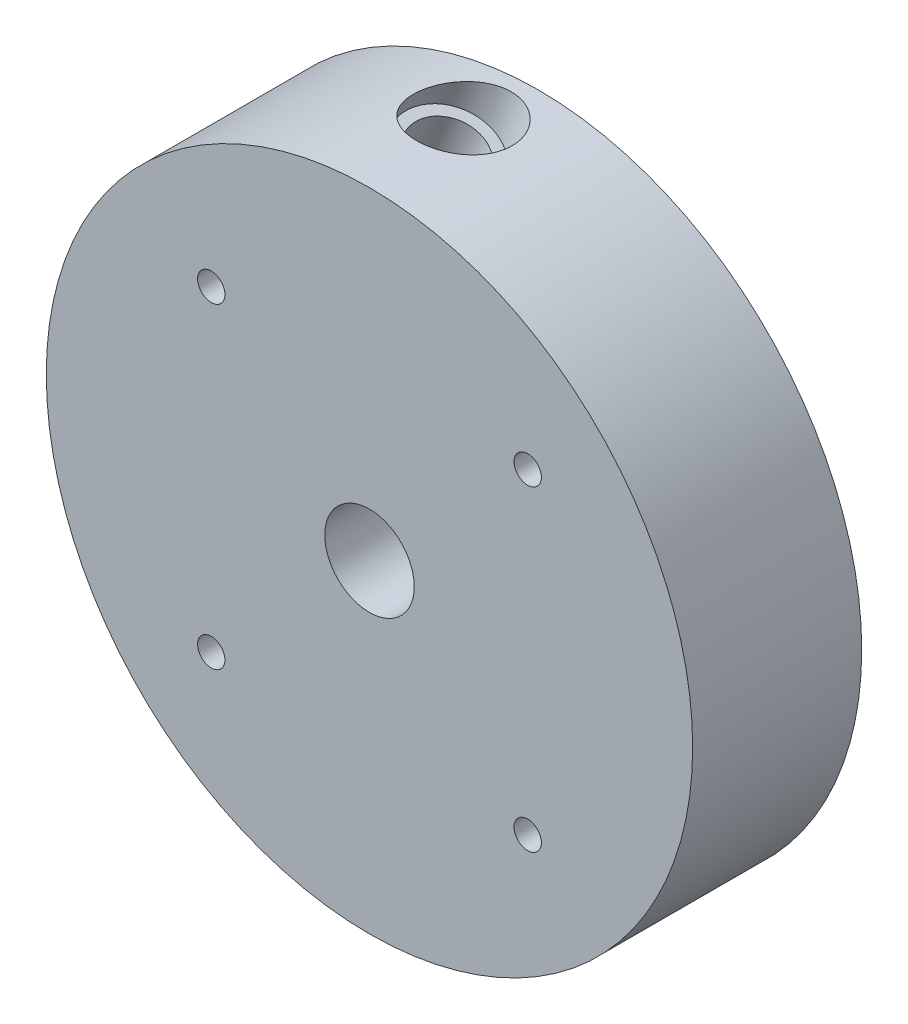
ISO-10303-21;
HEADER;
FILE_DESCRIPTION(('STEP AP214'),'2;1');
FILE_NAME('part.step','',(''),(''),'','','');
FILE_SCHEMA(('AUTOMOTIVE_DESIGN { 1 0 10303 214 1 1 1 1 }'));
ENDSEC;
DATA;
#1=APPLICATION_CONTEXT('core data for automotive mechanical design processes');
#2=APPLICATION_PROTOCOL_DEFINITION('international standard','automotive_design',2000,#1);
#3=PRODUCT_CONTEXT('',#1,'mechanical');
#4=PRODUCT('Part','Part','',(#3));
#5=PRODUCT_RELATED_PRODUCT_CATEGORY('part','',(#4));
#6=PRODUCT_DEFINITION_FORMATION('','',#4);
#7=PRODUCT_DEFINITION_CONTEXT('part definition',#1,'design');
#8=PRODUCT_DEFINITION('design','',#6,#7);
#9=PRODUCT_DEFINITION_SHAPE('','',#8);
#10=(LENGTH_UNIT() NAMED_UNIT(*) SI_UNIT(.MILLI.,.METRE.));
#11=(NAMED_UNIT(*) PLANE_ANGLE_UNIT() SI_UNIT($,.RADIAN.));
#12=(NAMED_UNIT(*) SI_UNIT($,.STERADIAN.) SOLID_ANGLE_UNIT());
#13=UNCERTAINTY_MEASURE_WITH_UNIT(LENGTH_MEASURE(1.E-05),#10,'distance_accuracy_value','');
#14=(GEOMETRIC_REPRESENTATION_CONTEXT(3) GLOBAL_UNCERTAINTY_ASSIGNED_CONTEXT((#13)) GLOBAL_UNIT_ASSIGNED_CONTEXT((#10,
#11,#12)) REPRESENTATION_CONTEXT('',''));
#15=CARTESIAN_POINT('',(0.,0.,0.));
#16=DIRECTION('',(0.,0.,1.));
#17=DIRECTION('',(1.,0.,0.));
#18=AXIS2_PLACEMENT_3D('',#15,#16,#17);
#19=CARTESIAN_POINT('',(0.,0.,34.));
#20=DIRECTION('',(0.,0.,1.));
#21=DIRECTION('',(1.,0.,0.));
#22=AXIS2_PLACEMENT_3D('',#19,#20,#21);
#23=PLANE('',#22);
#24=CARTESIAN_POINT('',(31.8198051533946,31.8198051533946,34.));
#25=DIRECTION('',(0.,0.,1.));
#26=DIRECTION('',(1.,0.,0.));
#27=AXIS2_PLACEMENT_3D('',#24,#25,#26);
#28=CIRCLE('',#27,2.74999999999999);
#29=CARTESIAN_POINT('',(34.5698051533946,31.8198051533946,34.));
#30=VERTEX_POINT('',#29);
#31=EDGE_CURVE('E185',#30,#30,#28,.T.);
#32=ORIENTED_EDGE('',*,*,#31,.F.);
#33=EDGE_LOOP('',(#32));
#34=FACE_BOUND('',#33,.T.);
#35=CARTESIAN_POINT('',(-31.8198051533946,-31.8198051533946,34.));
#36=DIRECTION('',(0.,0.,1.));
#37=DIRECTION('',(1.,0.,0.));
#38=AXIS2_PLACEMENT_3D('',#35,#36,#37);
#39=CIRCLE('',#38,2.74999999999999);
#40=CARTESIAN_POINT('',(-29.0698051533946,-31.8198051533946,34.));
#41=VERTEX_POINT('',#40);
#42=EDGE_CURVE('E189',#41,#41,#39,.T.);
#43=ORIENTED_EDGE('',*,*,#42,.F.);
#44=EDGE_LOOP('',(#43));
#45=FACE_BOUND('',#44,.T.);
#46=CARTESIAN_POINT('',(0.,0.,34.));
#47=DIRECTION('',(0.,0.,1.));
#48=DIRECTION('',(1.,0.,0.));
#49=AXIS2_PLACEMENT_3D('',#46,#47,#48);
#50=CIRCLE('',#49,65.);
#51=CARTESIAN_POINT('',(65.,0.,34.));
#52=VERTEX_POINT('',#51);
#53=EDGE_CURVE('E12',#52,#52,#50,.T.);
#54=ORIENTED_EDGE('',*,*,#53,.T.);
#55=EDGE_LOOP('',(#54));
#56=FACE_BOUND('',#55,.T.);
#57=CARTESIAN_POINT('',(-31.8198051533946,31.8198051533946,34.));
#58=DIRECTION('',(0.,0.,1.));
#59=DIRECTION('',(1.,0.,0.));
#60=AXIS2_PLACEMENT_3D('',#57,#58,#59);
#61=CIRCLE('',#60,2.74999999999999);
#62=CARTESIAN_POINT('',(-29.0698051533946,31.8198051533946,34.));
#63=VERTEX_POINT('',#62);
#64=EDGE_CURVE('E195',#63,#63,#61,.T.);
#65=ORIENTED_EDGE('',*,*,#64,.F.);
#66=EDGE_LOOP('',(#65));
#67=FACE_BOUND('',#66,.T.);
#68=CARTESIAN_POINT('',(31.8198051533946,-31.8198051533946,34.));
#69=DIRECTION('',(0.,0.,1.));
#70=DIRECTION('',(1.,0.,0.));
#71=AXIS2_PLACEMENT_3D('',#68,#69,#70);
#72=CIRCLE('',#71,2.74999999999999);
#73=CARTESIAN_POINT('',(34.5698051533946,-31.8198051533946,34.));
#74=VERTEX_POINT('',#73);
#75=EDGE_CURVE('E199',#74,#74,#72,.T.);
#76=ORIENTED_EDGE('',*,*,#75,.F.);
#77=EDGE_LOOP('',(#76));
#78=FACE_BOUND('',#77,.T.);
#79=CARTESIAN_POINT('',(0.,0.,34.));
#80=DIRECTION('',(0.,0.,1.));
#81=DIRECTION('',(1.,0.,0.));
#82=AXIS2_PLACEMENT_3D('',#79,#80,#81);
#83=CIRCLE('',#82,9.);
#84=CARTESIAN_POINT('',(9.,0.,34.));
#85=VERTEX_POINT('',#84);
#86=EDGE_CURVE('E202',#85,#85,#83,.T.);
#87=ORIENTED_EDGE('',*,*,#86,.F.);
#88=EDGE_LOOP('',(#87));
#89=FACE_BOUND('',#88,.T.);
#90=ADVANCED_FACE('F51',(#34,#45,#56,#67,#78,#89),#23,.T.);
#91=CARTESIAN_POINT('',(0.,-143.141421356237,20.));
#92=DIRECTION('',(0.,0.,1.));
#93=DIRECTION('',(1.,0.,0.));
#94=AXIS2_PLACEMENT_3D('',#91,#92,#93);
#95=PLANE('',#94);
#96=CARTESIAN_POINT('',(-8.41161896583205,31.3925893543947,20.));
#97=CARTESIAN_POINT('',(-6.59498655692887,31.9273439059173,20.));
#98=CARTESIAN_POINT('',(-4.72759665589687,32.3040116625754,20.));
#99=CARTESIAN_POINT('',(-0.947579393855885,32.7269500427533,20.));
#100=CARTESIAN_POINT('',(0.964989800608965,32.7732083727551,20.));
#101=CARTESIAN_POINT('',(4.77710877725085,32.5310810574549,20.));
#102=CARTESIAN_POINT('',(6.6765988909068,32.2426934409023,20.));
#103=CARTESIAN_POINT('',(10.4042078217419,31.337263885961,20.));
#104=CARTESIAN_POINT('',(12.2322672936029,30.7202304457304,20.));
#105=CARTESIAN_POINT('',(15.760360447992,29.173637757705,20.));
#106=CARTESIAN_POINT('',(17.4603369387661,28.2440973030589,20.));
#107=CARTESIAN_POINT('',(20.6790622470469,26.098347596263,20.));
#108=CARTESIAN_POINT('',(22.1977578054618,24.8821669390156,20.));
#109=CARTESIAN_POINT('',(25.0058356427531,22.198009272827,20.));
#110=CARTESIAN_POINT('',(26.2951702677157,20.7300698610981,20.));
#111=CARTESIAN_POINT('',(28.6030770399887,17.5852862615814,20.));
#112=CARTESIAN_POINT('',(29.621608652021,15.9084875898363,20.));
#113=CARTESIAN_POINT('',(31.3544252087226,12.3956449637935,20.));
#114=CARTESIAN_POINT('',(32.0686780431636,10.5596531079759,20.));
#115=CARTESIAN_POINT('',(33.1685124520496,6.78338183568033,20.));
#116=CARTESIAN_POINT('',(33.554071398709,4.84315954999618,20.));
#117=CARTESIAN_POINT('',(33.9819779982146,0.9170386600299,20.));
#118=CARTESIAN_POINT('',(34.0243132794646,-1.06879949890293,20.));
#119=CARTESIAN_POINT('',(33.7616448126502,-5.02565789488448,20.));
#120=CARTESIAN_POINT('',(33.4566394131377,-6.99661620578227,20.));
#121=CARTESIAN_POINT('',(32.5057860053459,-10.8631805220921,20.));
#122=CARTESIAN_POINT('',(31.8599472031514,-12.7587250146704,20.));
#123=CARTESIAN_POINT('',(30.2444344658908,-16.4157462169828,20.));
#124=CARTESIAN_POINT('',(29.274780398416,-18.1771637237506,20.));
#125=CARTESIAN_POINT('',(27.0387184652918,-21.5108525379583,20.));
#126=CARTESIAN_POINT('',(25.772340602703,-23.0830687928153,20.));
#127=CARTESIAN_POINT('',(22.9792358346881,-25.9886347223964,20.));
#128=CARTESIAN_POINT('',(21.4525482253563,-27.3219352222074,20.));
#129=CARTESIAN_POINT('',(18.1835090503277,-29.7068773521282,20.));
#130=CARTESIAN_POINT('',(16.4412049384089,-30.7584772449035,20.));
#131=CARTESIAN_POINT('',(12.7925922031796,-32.5455235820591,20.));
#132=CARTESIAN_POINT('',(10.8863377957731,-33.2809370698108,20.));
#133=CARTESIAN_POINT('',(6.96692751775982,-34.4105391787325,20.));
#134=CARTESIAN_POINT('',(4.95383101040614,-34.8047047072262,20.));
#135=CARTESIAN_POINT('',(0.881572969327515,-35.2370073616113,20.));
#136=CARTESIAN_POINT('',(-1.17752583972078,-35.2751320467303,20.));
#137=CARTESIAN_POINT('',(-5.27905712721527,-34.9913531552568,20.));
#138=CARTESIAN_POINT('',(-7.3214254229152,-34.669448255876,20.));
#139=CARTESIAN_POINT('',(-11.3267805742622,-33.6726219752596,20.));
#140=CARTESIAN_POINT('',(-13.2897037521198,-32.9977105165779,20.));
#141=CARTESIAN_POINT('',(-17.0753954472404,-31.3127657075608,20.));
#142=CARTESIAN_POINT('',(-18.898102754332,-30.3027533072263,20.));
#143=CARTESIAN_POINT('',(-22.3464123691171,-27.9759197387277,20.));
#144=CARTESIAN_POINT('',(-23.9719578360684,-26.6591299889305,20.));
#145=CARTESIAN_POINT('',(-26.9745944537781,-23.7566853350126,20.));
#146=CARTESIAN_POINT('',(-28.3516349151178,-22.1710714319796,20.));
#147=CARTESIAN_POINT('',(-30.8131330293807,-18.7774625019632,20.));
#148=CARTESIAN_POINT('',(-31.897547750371,-16.9695168713819,20.));
#149=CARTESIAN_POINT('',(-33.7382971452239,-13.1849080344906,20.));
#150=CARTESIAN_POINT('',(-34.4945980242525,-11.2083011650251,20.));
#151=CARTESIAN_POINT('',(-35.653409824858,-7.14562096872495,20.));
#152=CARTESIAN_POINT('',(-36.0558971975498,-5.05960923964018,20.));
#153=CARTESIAN_POINT('',(-36.492023630975,-0.841182207962756,20.));
#154=CARTESIAN_POINT('',(-36.5256501906637,1.2911680901299,20.));
#155=CARTESIAN_POINT('',(-36.2201917845468,5.5373040638973,20.));
#156=CARTESIAN_POINT('',(-35.8811058334673,7.65102330129104,20.));
#157=CARTESIAN_POINT('',(-34.8377581321816,11.7950031172486,20.));
#158=CARTESIAN_POINT('',(-34.1335070295338,13.8251978556522,20.));
#159=CARTESIAN_POINT('',(-32.3786188729451,17.739300975288,20.));
#160=CARTESIAN_POINT('',(-31.32800385937,19.6231461431737,20.));
#161=CARTESIAN_POINT('',(-30.1189720521702,21.4044393180619,20.));
#162=B_SPLINE_CURVE_WITH_KNOTS('',3,(#96,#97,#98,#99,#100,#101,#102,#103,#104,#105,#106,#107,
#108,#109,#110,#111,#112,#113,#114,#115,#116,#117,#118,#119,#120,#121,#122,#123,#124,#125,#126,
#127,#128,#129,#130,#131,#132,#133,#134,#135,#136,#137,#138,#139,#140,#141,#142,#143,#144,#145,
#146,#147,#148,#149,#150,#151,#152,#153,#154,#155,#156,#157,#158,#159,#160,#161),.UNSPECIFIED.,
.F.,.F.,(4,2,2,2,2,2,2,2,2,2,2,2,2,2,2,2,2,2,2,2,2,2,2,2,2,2,2,2,2,2,2,2,4),(0.,0.03125,0.0625,
0.09375,0.125,0.15625,0.1875,0.21875,0.25,0.28125,0.3125,0.34375,0.375,0.40625,0.4375,0.46875,
0.5,0.53125,0.5625,0.59375,0.625,0.65625,0.6875,0.71875,0.75,0.78125,0.8125,0.84375,0.875,
0.90625,0.9375,0.96875,1.),.UNSPECIFIED.);
#163=CARTESIAN_POINT('',(-8.41161896583206,31.3925893543947,20.));
#164=VERTEX_POINT('',#163);
#165=CARTESIAN_POINT('',(-30.1189720521702,21.4044393180619,20.));
#166=VERTEX_POINT('',#165);
#167=EDGE_CURVE('E103',#164,#166,#162,.T.);
#168=ORIENTED_EDGE('',*,*,#167,.T.);
#169=CARTESIAN_POINT('',(-54.9413211734085,38.25231705098,20.));
#170=DIRECTION('',(0.,0.,1.));
#171=DIRECTION('',(1.,0.,0.));
#172=AXIS2_PLACEMENT_3D('',#169,#170,#171);
#173=CIRCLE('',#172,30.);
#174=CARTESIAN_POINT('',(-27.2378809360153,26.7406100093122,20.));
#175=VERTEX_POINT('',#174);
#176=EDGE_CURVE('E240',#166,#175,#173,.T.);
#177=ORIENTED_EDGE('',*,*,#176,.T.);
#178=DIRECTION('',(0.383723568055596,0.923448007913105,0.));
#179=VECTOR('',#178,1.);
#180=CARTESIAN_POINT('',(-83.4247604050742,-108.475640010126,20.));
#181=LINE('',#180,#179);
#182=CARTESIAN_POINT('',(-20.4213282581559,43.144950308504,20.));
#183=VERTEX_POINT('',#182);
#184=EDGE_CURVE('E243',#175,#183,#181,.T.);
#185=ORIENTED_EDGE('',*,*,#184,.T.);
#186=DIRECTION('',(0.923448007913106,-0.383723568055595,0.));
#187=VECTOR('',#186,1.);
#188=CARTESIAN_POINT('',(63.0034321469183,8.47916896239231,20.));
#189=LINE('',#188,#187);
#190=CARTESIAN_POINT('',(-6.01553933471141,37.1588626468367,20.));
#191=VERTEX_POINT('',#190);
#192=EDGE_CURVE('E245',#183,#191,#189,.T.);
#193=ORIENTED_EDGE('',*,*,#192,.T.);
#194=DIRECTION('',(0.383723568055595,0.923448007913106,0.));
#195=VECTOR('',#194,1.);
#196=CARTESIAN_POINT('',(-69.0189714816297,-114.461727671793,20.));
#197=LINE('',#196,#195);
#198=EDGE_CURVE('E145',#164,#191,#197,.T.);
#199=ORIENTED_EDGE('',*,*,#198,.F.);
#200=EDGE_LOOP('',(#168,#177,#185,#193,#199));
#201=FACE_BOUND('',#200,.T.);
#202=CARTESIAN_POINT('',(0.,0.,20.));
#203=DIRECTION('',(0.,0.,1.));
#204=DIRECTION('',(1.,0.,0.));
#205=AXIS2_PLACEMENT_3D('',#202,#203,#204);
#206=CIRCLE('',#205,9.);
#207=CARTESIAN_POINT('',(9.,0.,20.));
#208=VERTEX_POINT('',#207);
#209=EDGE_CURVE('E127',#208,#208,#206,.F.);
#210=ORIENTED_EDGE('',*,*,#209,.F.);
#211=EDGE_LOOP('',(#210));
#212=FACE_BOUND('',#211,.T.);
#213=ADVANCED_FACE('F174',(#201,#212),#95,.F.);
#214=CARTESIAN_POINT('',(0.,0.,34.));
#215=DIRECTION('',(0.,0.,-1.));
#216=DIRECTION('',(-1.,0.,0.));
#217=AXIS2_PLACEMENT_3D('',#214,#215,#216);
#218=CYLINDRICAL_SURFACE('',#217,65.);
#219=CARTESIAN_POINT('',(6.70862149546253,64.6528761744643,12.));
#220=CARTESIAN_POINT('',(6.70862863593975,64.6528737876331,12.2440602131591));
#221=CARTESIAN_POINT('',(6.69831446078737,64.6539477217531,12.4880394425842));
#222=CARTESIAN_POINT('',(6.65715331316661,64.6581997376182,12.9743098057111));
#223=CARTESIAN_POINT('',(6.62630417738931,64.6613780410535,13.2166007588394));
#224=CARTESIAN_POINT('',(6.54428616044041,64.6697301662803,13.697779624472));
#225=CARTESIAN_POINT('',(6.49310845708397,64.6749048544341,13.9366660127769));
#226=CARTESIAN_POINT('',(6.3708369303044,64.6870637031278,14.4092400824856));
#227=CARTESIAN_POINT('',(6.29974314272405,64.6940478604112,14.6429277732447));
#228=CARTESIAN_POINT('',(6.1382559961698,64.7095694670644,15.1032856547145));
#229=CARTESIAN_POINT('',(6.04787696734837,64.7181057624048,15.3299609136875));
#230=CARTESIAN_POINT('',(5.84849477879562,64.7364281067472,15.7749124112064));
#231=CARTESIAN_POINT('',(5.73949155428674,64.7462141600958,15.9931886205358));
#232=CARTESIAN_POINT('',(5.50372455529881,64.7666813049862,16.419847904495));
#233=CARTESIAN_POINT('',(5.3769628084524,64.77736229429,16.6282321049429));
#234=CARTESIAN_POINT('',(5.10665188357947,64.7992321315168,17.0337798519399));
#235=CARTESIAN_POINT('',(4.96310257587059,64.8104209833625,17.2309433117923));
#236=CARTESIAN_POINT('',(4.65856904796563,64.8330263559602,17.615029580257));
#237=CARTESIAN_POINT('',(4.49740259282345,64.844444013642,17.8018077951525));
#238=CARTESIAN_POINT('',(4.16027011758781,64.8669460153012,18.1615052938711));
#239=CARTESIAN_POINT('',(3.98430404808608,64.8780303581658,18.3344245314226));
#240=CARTESIAN_POINT('',(3.61889994428861,64.8994379841282,18.6654518048006));
#241=CARTESIAN_POINT('',(3.42946118514046,64.9097612262168,18.8235590426557));
#242=CARTESIAN_POINT('',(3.0385150493633,64.9292363185685,19.1241633812321));
#243=CARTESIAN_POINT('',(2.83700690678558,64.9383880943721,19.2666594896112));
#244=CARTESIAN_POINT('',(2.41551398551353,64.9554573531595,19.5405095815589));
#245=CARTESIAN_POINT('',(2.19511809465303,64.9633147314239,19.6712345545247));
#246=CARTESIAN_POINT('',(1.74453182254011,64.9769760121728,19.9146536865985));
#247=CARTESIAN_POINT('',(1.5143412435897,64.9827798731866,20.0273474815427));
#248=CARTESIAN_POINT('',(1.04579954978463,64.9920087558995,20.2343619628552));
#249=CARTESIAN_POINT('',(0.807448281998344,64.9954337329926,20.3286823046825));
#250=CARTESIAN_POINT('',(0.324119499996226,64.9996413828254,20.4987940273427));
#251=CARTESIAN_POINT('',(0.0791396589429435,65.0004231152485,20.57457880538));
#252=CARTESIAN_POINT('',(-0.431783120191089,64.9990995555246,20.7118266243387));
#253=CARTESIAN_POINT('',(-0.698058810893015,64.9968047448231,20.772050199955));
#254=CARTESIAN_POINT('',(-1.23453329632379,64.9888294144091,20.8715177434694));
#255=CARTESIAN_POINT('',(-1.50473352722616,64.9831476231475,20.9107538216849));
#256=CARTESIAN_POINT('',(-2.04723823503431,64.9683183039784,20.9684274313606));
#257=CARTESIAN_POINT('',(-2.3195425756083,64.959170998798,20.9868662991459));
#258=CARTESIAN_POINT('',(-2.86465939662003,64.9374188335301,21.0032700317372));
#259=CARTESIAN_POINT('',(-3.13747202448302,64.9248127322783,21.0012275375822));
#260=CARTESIAN_POINT('',(-3.99899289535206,64.8795399943541,20.9628798499236));
#261=CARTESIAN_POINT('',(-4.58611048119513,64.8405929767555,20.8894916634749));
#262=CARTESIAN_POINT('',(-5.74077961390687,64.7485861291882,20.65237025896));
#263=CARTESIAN_POINT('',(-6.30832268974307,64.6955202736352,20.4885984351729));
#264=CARTESIAN_POINT('',(-7.1515795701115,64.6060539757711,20.1719908673613));
#265=CARTESIAN_POINT('',(-7.43957536350147,64.573475238124,20.0499001920324));
#266=CARTESIAN_POINT('',(-8.00411684166495,64.5059281189171,19.7818909640819));
#267=CARTESIAN_POINT('',(-8.28066047114717,64.4709593113765,19.6359681573996));
#268=CARTESIAN_POINT('',(-8.82018561827354,64.3993672311366,19.3207718960622));
#269=CARTESIAN_POINT('',(-9.08315587341249,64.3627426303461,19.1514794651724));
#270=CARTESIAN_POINT('',(-9.59282442469984,64.2887546790096,18.7903048247672));
#271=CARTESIAN_POINT('',(-9.83953093041625,64.2513917137466,18.5984341505845));
#272=CARTESIAN_POINT('',(-10.3096443497893,64.1776188580667,18.1966394259469));
#273=CARTESIAN_POINT('',(-10.5334095117744,64.1412045070879,17.9871361299035));
#274=CARTESIAN_POINT('',(-10.9603096082521,64.0696376178781,17.5477741489662));
#275=CARTESIAN_POINT('',(-11.1634427910002,64.034485186953,17.3179137387614));
#276=CARTESIAN_POINT('',(-11.5457776621604,63.9666527239038,16.8394236205065));
#277=CARTESIAN_POINT('',(-11.7250241123022,63.9339681185772,16.5908304252933));
#278=CARTESIAN_POINT('',(-12.0568998765106,63.8722136231136,16.0760850719643));
#279=CARTESIAN_POINT('',(-12.2095408110796,63.8431421564646,15.8099406500705));
#280=CARTESIAN_POINT('',(-12.445755064896,63.797439115558,15.3404684519493));
#281=CARTESIAN_POINT('',(-12.5366073627278,63.779625120276,15.1408902821424));
#282=CARTESIAN_POINT('',(-12.7020445463578,63.7468836918981,14.7348884008751));
#283=CARTESIAN_POINT('',(-12.776633078826,63.7319556118061,14.528466235962));
#284=CARTESIAN_POINT('',(-12.9085058666858,63.7053765858431,14.1100953903202));
#285=CARTESIAN_POINT('',(-12.9658010919239,63.6937235627948,13.8981503061013));
#286=CARTESIAN_POINT('',(-13.0623129060243,63.6740010840637,13.4699976633616));
#287=CARTESIAN_POINT('',(-13.1015288067649,63.6659317647814,13.253789942926));
#288=CARTESIAN_POINT('',(-13.1613527571319,63.6535916870548,12.8180208718818));
#289=CARTESIAN_POINT('',(-13.181903148518,63.6493326994269,12.59845124591));
#290=CARTESIAN_POINT('',(-13.2038494194311,63.6447836666885,12.1583136819522));
#291=CARTESIAN_POINT('',(-13.2052453866201,63.644493603414,11.9377457485397));
#292=CARTESIAN_POINT('',(-13.1888593296512,63.6478912286185,11.4973405994989));
#293=CARTESIAN_POINT('',(-13.1710758662198,63.6515792156206,11.2775034399517));
#294=CARTESIAN_POINT('',(-13.1166228180322,63.6628225537595,10.8402900683409));
#295=CARTESIAN_POINT('',(-13.0799536164812,63.6703778264263,10.6229138064353));
#296=CARTESIAN_POINT('',(-12.990472659419,63.6886928350445,10.2023590018608));
#297=CARTESIAN_POINT('',(-12.9385008085808,63.6992852311834,9.99899341499018));
#298=CARTESIAN_POINT('',(-12.818627129714,63.7235163405073,9.59713212348684));
#299=CARTESIAN_POINT('',(-12.7507198130587,63.737156103214,9.39863812284455));
#300=CARTESIAN_POINT('',(-12.5998569109551,63.767150725463,9.00773496892496));
#301=CARTESIAN_POINT('',(-12.5169049840279,63.7835049248315,8.81532434963131));
#302=CARTESIAN_POINT('',(-12.3368584411999,63.8185735990147,8.43739120915015));
#303=CARTESIAN_POINT('',(-12.2397584243752,63.8372889748226,8.25187135255086));
#304=CARTESIAN_POINT('',(-12.0247491747292,63.8781514769935,7.87510030886058));
#305=CARTESIAN_POINT('',(-11.9058319617654,63.9004500487675,7.68444029581984));
#306=CARTESIAN_POINT('',(-11.6540741410917,63.9468448950392,7.3127421077129));
#307=CARTESIAN_POINT('',(-11.5212284359023,63.9709418267553,7.13170749208833));
#308=CARTESIAN_POINT('',(-11.1036102071395,64.0452151404346,6.60399405215833));
#309=CARTESIAN_POINT('',(-10.7996645223129,64.0973919350526,6.27254667366106));
#310=CARTESIAN_POINT('',(-10.1000834963696,64.2116220391093,5.60660208890718));
#311=CARTESIAN_POINT('',(-9.6975359107581,64.2739602821429,5.27947380243126));
#312=CARTESIAN_POINT('',(-8.84843594757926,64.396342925525,4.68734903471899));
#313=CARTESIAN_POINT('',(-8.40185663797956,64.4563858904199,4.42239091894046));
#314=CARTESIAN_POINT('',(-7.67375500200624,64.5459932970475,4.05701081992447));
#315=CARTESIAN_POINT('',(-7.40322492225855,64.5776199537075,3.93465493935364));
#316=CARTESIAN_POINT('',(-6.85306961641395,64.6383158518031,3.71173843601213));
#317=CARTESIAN_POINT('',(-6.57344657931512,64.6673857026008,3.61117261162305));
#318=CARTESIAN_POINT('',(-6.00673597844798,64.7224864160455,3.43229941171575));
#319=CARTESIAN_POINT('',(-5.71964471689865,64.748515736801,3.35400330082276));
#320=CARTESIAN_POINT('',(-5.13986407356774,64.7971174154942,3.22025141681305));
#321=CARTESIAN_POINT('',(-4.84717404961873,64.8196893741721,3.16479828038007));
#322=CARTESIAN_POINT('',(-4.24055816238636,64.8622809489315,3.07469425515809));
#323=CARTESIAN_POINT('',(-3.92640239866936,64.8820697814389,3.04147223110085));
#324=CARTESIAN_POINT('',(-3.29625544424695,64.9171336587109,3.00192900671419));
#325=CARTESIAN_POINT('',(-2.98026494803042,64.9324103106335,2.99559821743045));
#326=CARTESIAN_POINT('',(-2.34868329162238,64.9583218863123,3.01039344747201));
#327=CARTESIAN_POINT('',(-2.03309218121389,64.9689562792145,3.03152260581328));
#328=CARTESIAN_POINT('',(-1.40490495190984,64.9855749065612,3.10172274986825));
#329=CARTESIAN_POINT('',(-1.09230864892763,64.9915594286619,3.15079200679148));
#330=CARTESIAN_POINT('',(-0.485369627075122,64.9988674770462,3.27462007292982));
#331=CARTESIAN_POINT('',(-0.190800489555643,65.0003700257084,3.34825748525719));
#332=CARTESIAN_POINT('',(0.390550552857869,64.9994765123423,3.52161401616566));
#333=CARTESIAN_POINT('',(0.677333162886932,64.9970808045389,3.62133076429124));
#334=CARTESIAN_POINT('',(1.24037849003178,64.9887737413312,3.84663023935143));
#335=CARTESIAN_POINT('',(1.51664552111228,64.9828638445124,3.97220222078732));
#336=CARTESIAN_POINT('',(2.05606685534245,64.9680335216791,4.24876453987161));
#337=CARTESIAN_POINT('',(2.31922235865541,64.9591133717913,4.39975254550497));
#338=CARTESIAN_POINT('',(2.80770739398508,64.939751394935,4.71225622990807));
#339=CARTESIAN_POINT('',(3.03434280842935,64.9295067548473,4.87174565009044));
#340=CARTESIAN_POINT('',(3.47234032921374,64.9075568077496,5.21037559903258));
#341=CARTESIAN_POINT('',(3.68370384816523,64.895851636109,5.38951430641376));
#342=CARTESIAN_POINT('',(4.08914618120146,64.8715664736918,5.7662587161657));
#343=CARTESIAN_POINT('',(4.2832287380358,64.8589866734005,5.96386040069046));
#344=CARTESIAN_POINT('',(4.65228780794932,64.8335595428751,6.37614961099065));
#345=CARTESIAN_POINT('',(4.8272654872537,64.8207122290279,6.59083609246861));
#346=CARTESIAN_POINT('',(5.14449374489422,64.7962780073769,7.01953809944175));
#347=CARTESIAN_POINT('',(5.28819590899069,64.7846671349222,7.2324795979056));
#348=CARTESIAN_POINT('',(5.55645492973808,64.7622106669086,7.67012590354934));
#349=CARTESIAN_POINT('',(5.68101307704903,64.751365019786,7.8948299163482));
#350=CARTESIAN_POINT('',(5.90983975124729,64.7308813720947,8.35421703291036));
#351=CARTESIAN_POINT('',(6.01412211278118,64.7212425496913,8.58889319826828));
#352=CARTESIAN_POINT('',(6.20158186995567,64.703548646678,9.06650648165859));
#353=CARTESIAN_POINT('',(6.28476220448923,64.6954933455654,9.3094424439935));
#354=CARTESIAN_POINT('',(6.47331737112557,64.6769673187625,9.95172347293865));
#355=CARTESIAN_POINT('',(6.56141569545987,64.6680078249453,10.3563218782971));
#356=CARTESIAN_POINT('',(6.67905997279725,64.6559644467939,11.1740244473931));
#357=CARTESIAN_POINT('',(6.70860941605664,64.6528802122201,11.5871281026263));
#358=CARTESIAN_POINT('',(6.70862149546253,64.6528761744643,12.));
#359=B_SPLINE_CURVE_WITH_KNOTS('',3,(#219,#220,#221,#222,#223,#224,#225,#226,#227,#228,#229,
#230,#231,#232,#233,#234,#235,#236,#237,#238,#239,#240,#241,#242,#243,#244,#245,#246,#247,#248,
#249,#250,#251,#252,#253,#254,#255,#256,#257,#258,#259,#260,#261,#262,#263,#264,#265,#266,#267,
#268,#269,#270,#271,#272,#273,#274,#275,#276,#277,#278,#279,#280,#281,#282,#283,#284,#285,#286,
#287,#288,#289,#290,#291,#292,#293,#294,#295,#296,#297,#298,#299,#300,#301,#302,#303,#304,#305,
#306,#307,#308,#309,#310,#311,#312,#313,#314,#315,#316,#317,#318,#319,#320,#321,#322,#323,#324,
#325,#326,#327,#328,#329,#330,#331,#332,#333,#334,#335,#336,#337,#338,#339,#340,#341,#342,#343,
#344,#345,#346,#347,#348,#349,#350,#351,#352,#353,#354,#355,#356,#357,#358),.UNSPECIFIED.,.T.,
.F.,(4,2,2,2,2,2,2,2,2,2,2,2,2,2,2,2,2,2,2,2,2,2,2,2,2,2,2,2,2,2,2,2,2,2,2,2,2,2,2,2,2,2,2,2,2,
2,2,2,2,2,2,2,2,2,2,2,2,2,2,2,2,2,2,2,2,2,2,2,2,4),(0.,0.731820881170318,1.46371887012184,
2.19593483554957,2.92814948322407,3.65982193213045,4.39149692594848,5.12308844656005,
5.85468561902242,6.59473333697408,7.33478352566176,8.07487356040744,8.81501061270598,
9.58326766762077,10.351540236556,11.1198272108383,11.8883874693662,12.7065335663174,
13.5249870074192,14.3433878557829,15.1620827664093,16.9328668137703,18.704407805255,
19.6469523141021,20.5896652523987,21.5331482304275,22.4761512543753,23.4009226838056,
24.3257725648176,25.2488642246647,26.171551689534,26.8309127173066,27.4901257504276,
28.1489197348496,28.8077387917251,29.46858610399,30.1294303918283,30.790324274563,
31.4512047478151,32.0810170116703,32.7110465199631,33.3409230237417,33.9710406110488,
34.6477690807796,35.3247460864466,36.678151830474,38.2396810128091,39.8021713014321,
40.6971373241204,41.5918894688328,42.4870934018245,43.3824006361052,44.3308091065535,
45.27887936236,46.227058004005,47.1751779835769,48.0848836294099,48.9945066171647,
49.9037523236778,50.8129146489336,51.6437851527458,52.4745787045097,53.3051918812213,
54.1357543261638,54.906258666668,55.6767110381521,56.4466358526322,57.216453380246,
58.4545342838174,59.6925413798348),.UNSPECIFIED.);
#360=CARTESIAN_POINT('',(6.70862149546253,64.6528761744643,12.));
#361=VERTEX_POINT('',#360);
#362=EDGE_CURVE('E56',#361,#361,#359,.T.);
#363=ORIENTED_EDGE('',*,*,#362,.T.);
#364=EDGE_LOOP('',(#363));
#365=FACE_BOUND('',#364,.T.);
#366=CARTESIAN_POINT('',(0.,0.,0.));
#367=DIRECTION('',(0.,0.,1.));
#368=DIRECTION('',(1.,0.,0.));
#369=AXIS2_PLACEMENT_3D('',#366,#367,#368);
#370=CIRCLE('',#369,65.);
#371=CARTESIAN_POINT('',(65.,0.,0.));
#372=VERTEX_POINT('',#371);
#373=EDGE_CURVE('E64',#372,#372,#370,.T.);
#374=ORIENTED_EDGE('',*,*,#373,.T.);
#375=EDGE_LOOP('',(#374));
#376=FACE_BOUND('',#375,.T.);
#377=ORIENTED_EDGE('',*,*,#53,.F.);
#378=EDGE_LOOP('',(#377));
#379=FACE_BOUND('',#378,.T.);
#380=ADVANCED_FACE('F53',(#365,#376,#379),#218,.T.);
#381=CARTESIAN_POINT('',(63.0034321469183,8.47916896239231,20.));
#382=DIRECTION('',(0.383723568055595,0.923448007913106,0.));
#383=DIRECTION('',(-0.923448007913106,0.383723568055595,0.));
#384=AXIS2_PLACEMENT_3D('',#381,#382,#383);
#385=PLANE('',#384);
#386=DIRECTION('',(0.923448007913106,-0.383723568055595,0.));
#387=VECTOR('',#386,1.);
#388=CARTESIAN_POINT('',(63.0034321469183,8.47916896239231,0.));
#389=LINE('',#388,#387);
#390=CARTESIAN_POINT('',(-20.4213282581559,43.144950308504,0.));
#391=VERTEX_POINT('',#390);
#392=CARTESIAN_POINT('',(-6.01553933471141,37.1588626468367,0.));
#393=VERTEX_POINT('',#392);
#394=EDGE_CURVE('E116',#391,#393,#389,.T.);
#395=ORIENTED_EDGE('',*,*,#394,.T.);
#396=DIRECTION('',(0.,0.,-1.));
#397=VECTOR('',#396,1.);
#398=CARTESIAN_POINT('',(-6.01553933471141,37.1588626468367,20.));
#399=LINE('',#398,#397);
#400=EDGE_CURVE('E107',#191,#393,#399,.T.);
#401=ORIENTED_EDGE('',*,*,#400,.F.);
#402=ORIENTED_EDGE('',*,*,#192,.F.);
#403=DIRECTION('',(0.,0.,-1.));
#404=VECTOR('',#403,1.);
#405=CARTESIAN_POINT('',(-20.4213282581559,43.144950308504,20.));
#406=LINE('',#405,#404);
#407=EDGE_CURVE('E235',#183,#391,#406,.T.);
#408=ORIENTED_EDGE('',*,*,#407,.T.);
#409=EDGE_LOOP('',(#395,#401,#402,#408));
#410=FACE_BOUND('',#409,.T.);
#411=CARTESIAN_POINT('',(-13.2184337964336,40.1519064776704,12.));
#412=DIRECTION('',(0.383723568055595,0.923448007913105,0.));
#413=DIRECTION('',(-0.923448007913106,0.383723568055595,0.));
#414=AXIS2_PLACEMENT_3D('',#411,#412,#413);
#415=CIRCLE('',#414,6.79999999999999);
#416=CARTESIAN_POINT('',(-19.4978802502427,42.7612267404485,12.));
#417=VERTEX_POINT('',#416);
#418=EDGE_CURVE('E124',#417,#417,#415,.T.);
#419=ORIENTED_EDGE('',*,*,#418,.T.);
#420=EDGE_LOOP('',(#419));
#421=FACE_BOUND('',#420,.T.);
#422=ADVANCED_FACE('F172',(#410,#421),#385,.F.);
#423=CARTESIAN_POINT('',(0.,0.,0.));
#424=DIRECTION('',(0.,0.,1.));
#425=DIRECTION('',(1.,0.,0.));
#426=AXIS2_PLACEMENT_3D('',#423,#424,#425);
#427=PLANE('',#426);
#428=CARTESIAN_POINT('',(-54.9413211734085,38.25231705098,0.));
#429=DIRECTION('',(0.,0.,1.));
#430=DIRECTION('',(1.,0.,0.));
#431=AXIS2_PLACEMENT_3D('',#428,#429,#430);
#432=CIRCLE('',#431,30.);
#433=CARTESIAN_POINT('',(-30.1189720521702,21.4044393180619,0.));
#434=VERTEX_POINT('',#433);
#435=CARTESIAN_POINT('',(-27.2378809360153,26.7406100093122,0.));
#436=VERTEX_POINT('',#435);
#437=EDGE_CURVE('E123',#434,#436,#432,.T.);
#438=ORIENTED_EDGE('',*,*,#437,.F.);
#439=CARTESIAN_POINT('',(-8.41161896583205,31.3925893543947,0.));
#440=CARTESIAN_POINT('',(-6.59498655692887,31.9273439059173,0.));
#441=CARTESIAN_POINT('',(-4.72759665589687,32.3040116625754,0.));
#442=CARTESIAN_POINT('',(-0.947579393855885,32.7269500427533,0.));
#443=CARTESIAN_POINT('',(0.964989800608965,32.7732083727551,0.));
#444=CARTESIAN_POINT('',(4.77710877725085,32.5310810574549,0.));
#445=CARTESIAN_POINT('',(6.6765988909068,32.2426934409023,0.));
#446=CARTESIAN_POINT('',(10.4042078217419,31.337263885961,0.));
#447=CARTESIAN_POINT('',(12.2322672936029,30.7202304457304,0.));
#448=CARTESIAN_POINT('',(15.760360447992,29.173637757705,0.));
#449=CARTESIAN_POINT('',(17.4603369387661,28.2440973030589,0.));
#450=CARTESIAN_POINT('',(20.6790622470469,26.098347596263,0.));
#451=CARTESIAN_POINT('',(22.1977578054618,24.8821669390156,0.));
#452=CARTESIAN_POINT('',(25.0058356427531,22.198009272827,0.));
#453=CARTESIAN_POINT('',(26.2951702677157,20.7300698610981,0.));
#454=CARTESIAN_POINT('',(28.6030770399887,17.5852862615814,0.));
#455=CARTESIAN_POINT('',(29.621608652021,15.9084875898363,0.));
#456=CARTESIAN_POINT('',(31.3544252087226,12.3956449637935,0.));
#457=CARTESIAN_POINT('',(32.0686780431636,10.5596531079759,0.));
#458=CARTESIAN_POINT('',(33.1685124520496,6.78338183568033,0.));
#459=CARTESIAN_POINT('',(33.554071398709,4.84315954999618,0.));
#460=CARTESIAN_POINT('',(33.9819779982146,0.9170386600299,0.));
#461=CARTESIAN_POINT('',(34.0243132794646,-1.06879949890293,0.));
#462=CARTESIAN_POINT('',(33.7616448126502,-5.02565789488448,0.));
#463=CARTESIAN_POINT('',(33.4566394131377,-6.99661620578227,0.));
#464=CARTESIAN_POINT('',(32.5057860053459,-10.8631805220921,0.));
#465=CARTESIAN_POINT('',(31.8599472031514,-12.7587250146704,0.));
#466=CARTESIAN_POINT('',(30.2444344658908,-16.4157462169828,0.));
#467=CARTESIAN_POINT('',(29.274780398416,-18.1771637237506,0.));
#468=CARTESIAN_POINT('',(27.0387184652918,-21.5108525379583,0.));
#469=CARTESIAN_POINT('',(25.772340602703,-23.0830687928153,0.));
#470=CARTESIAN_POINT('',(22.9792358346881,-25.9886347223964,0.));
#471=CARTESIAN_POINT('',(21.4525482253563,-27.3219352222074,0.));
#472=CARTESIAN_POINT('',(18.1835090503277,-29.7068773521282,0.));
#473=CARTESIAN_POINT('',(16.4412049384089,-30.7584772449035,0.));
#474=CARTESIAN_POINT('',(12.7925922031796,-32.5455235820591,0.));
#475=CARTESIAN_POINT('',(10.8863377957731,-33.2809370698108,0.));
#476=CARTESIAN_POINT('',(6.96692751775982,-34.4105391787325,0.));
#477=CARTESIAN_POINT('',(4.95383101040614,-34.8047047072262,0.));
#478=CARTESIAN_POINT('',(0.881572969327515,-35.2370073616113,0.));
#479=CARTESIAN_POINT('',(-1.17752583972078,-35.2751320467303,0.));
#480=CARTESIAN_POINT('',(-5.27905712721527,-34.9913531552568,0.));
#481=CARTESIAN_POINT('',(-7.3214254229152,-34.669448255876,0.));
#482=CARTESIAN_POINT('',(-11.3267805742622,-33.6726219752596,0.));
#483=CARTESIAN_POINT('',(-13.2897037521198,-32.9977105165779,0.));
#484=CARTESIAN_POINT('',(-17.0753954472404,-31.3127657075608,0.));
#485=CARTESIAN_POINT('',(-18.898102754332,-30.3027533072263,0.));
#486=CARTESIAN_POINT('',(-22.3464123691171,-27.9759197387277,0.));
#487=CARTESIAN_POINT('',(-23.9719578360684,-26.6591299889305,0.));
#488=CARTESIAN_POINT('',(-26.9745944537781,-23.7566853350126,0.));
#489=CARTESIAN_POINT('',(-28.3516349151178,-22.1710714319796,0.));
#490=CARTESIAN_POINT('',(-30.8131330293807,-18.7774625019632,0.));
#491=CARTESIAN_POINT('',(-31.897547750371,-16.9695168713819,0.));
#492=CARTESIAN_POINT('',(-33.7382971452239,-13.1849080344906,0.));
#493=CARTESIAN_POINT('',(-34.4945980242525,-11.2083011650251,0.));
#494=CARTESIAN_POINT('',(-35.653409824858,-7.14562096872495,0.));
#495=CARTESIAN_POINT('',(-36.0558971975498,-5.05960923964018,0.));
#496=CARTESIAN_POINT('',(-36.492023630975,-0.841182207962756,0.));
#497=CARTESIAN_POINT('',(-36.5256501906637,1.2911680901299,0.));
#498=CARTESIAN_POINT('',(-36.2201917845468,5.5373040638973,0.));
#499=CARTESIAN_POINT('',(-35.8811058334673,7.65102330129104,0.));
#500=CARTESIAN_POINT('',(-34.8377581321816,11.7950031172486,0.));
#501=CARTESIAN_POINT('',(-34.1335070295338,13.8251978556522,0.));
#502=CARTESIAN_POINT('',(-32.3786188729451,17.739300975288,0.));
#503=CARTESIAN_POINT('',(-31.32800385937,19.6231461431737,0.));
#504=CARTESIAN_POINT('',(-30.1189720521702,21.4044393180619,0.));
#505=B_SPLINE_CURVE_WITH_KNOTS('',3,(#439,#440,#441,#442,#443,#444,#445,#446,#447,#448,#449,
#450,#451,#452,#453,#454,#455,#456,#457,#458,#459,#460,#461,#462,#463,#464,#465,#466,#467,#468,
#469,#470,#471,#472,#473,#474,#475,#476,#477,#478,#479,#480,#481,#482,#483,#484,#485,#486,#487,
#488,#489,#490,#491,#492,#493,#494,#495,#496,#497,#498,#499,#500,#501,#502,#503,#504),
.UNSPECIFIED.,.F.,.F.,(4,2,2,2,2,2,2,2,2,2,2,2,2,2,2,2,2,2,2,2,2,2,2,2,2,2,2,2,2,2,2,2,4),(0.,
0.03125,0.0625,0.09375,0.125,0.15625,0.1875,0.21875,0.25,0.28125,0.3125,0.34375,0.375,0.40625,
0.4375,0.46875,0.5,0.53125,0.5625,0.59375,0.625,0.65625,0.6875,0.71875,0.75,0.78125,0.8125,
0.84375,0.875,0.90625,0.9375,0.96875,1.),.UNSPECIFIED.);
#506=CARTESIAN_POINT('',(-8.41161896583206,31.3925893543947,0.));
#507=VERTEX_POINT('',#506);
#508=EDGE_CURVE('E72',#507,#434,#505,.T.);
#509=ORIENTED_EDGE('',*,*,#508,.F.);
#510=DIRECTION('',(0.383723568055595,0.923448007913106,0.));
#511=VECTOR('',#510,1.);
#512=CARTESIAN_POINT('',(-69.0189714816297,-114.461727671793,0.));
#513=LINE('',#512,#511);
#514=EDGE_CURVE('E110',#507,#393,#513,.T.);
#515=ORIENTED_EDGE('',*,*,#514,.T.);
#516=ORIENTED_EDGE('',*,*,#394,.F.);
#517=DIRECTION('',(0.383723568055596,0.923448007913105,0.));
#518=VECTOR('',#517,1.);
#519=CARTESIAN_POINT('',(-83.4247604050742,-108.475640010126,0.));
#520=LINE('',#519,#518);
#521=EDGE_CURVE('E137',#436,#391,#520,.T.);
#522=ORIENTED_EDGE('',*,*,#521,.F.);
#523=EDGE_LOOP('',(#438,#509,#515,#516,#522));
#524=FACE_BOUND('',#523,.T.);
#525=CARTESIAN_POINT('',(31.8198051533946,-31.8198051533946,0.));
#526=DIRECTION('',(0.,0.,1.));
#527=DIRECTION('',(1.,0.,0.));
#528=AXIS2_PLACEMENT_3D('',#525,#526,#527);
#529=CIRCLE('',#528,2.74999999999999);
#530=CARTESIAN_POINT('',(34.5698051533946,-31.8198051533946,0.));
#531=VERTEX_POINT('',#530);
#532=EDGE_CURVE('E228',#531,#531,#529,.T.);
#533=ORIENTED_EDGE('',*,*,#532,.T.);
#534=EDGE_LOOP('',(#533));
#535=FACE_BOUND('',#534,.T.);
#536=CARTESIAN_POINT('',(-31.8198051533946,31.8198051533946,0.));
#537=DIRECTION('',(0.,0.,1.));
#538=DIRECTION('',(1.,0.,0.));
#539=AXIS2_PLACEMENT_3D('',#536,#537,#538);
#540=CIRCLE('',#539,2.74999999999999);
#541=CARTESIAN_POINT('',(-29.0698051533946,31.8198051533946,0.));
#542=VERTEX_POINT('',#541);
#543=EDGE_CURVE('E220',#542,#542,#540,.T.);
#544=ORIENTED_EDGE('',*,*,#543,.T.);
#545=EDGE_LOOP('',(#544));
#546=FACE_BOUND('',#545,.T.);
#547=ORIENTED_EDGE('',*,*,#373,.F.);
#548=EDGE_LOOP('',(#547));
#549=FACE_BOUND('',#548,.T.);
#550=CARTESIAN_POINT('',(-31.8198051533946,-31.8198051533946,0.));
#551=DIRECTION('',(0.,0.,1.));
#552=DIRECTION('',(1.,0.,0.));
#553=AXIS2_PLACEMENT_3D('',#550,#551,#552);
#554=CIRCLE('',#553,2.74999999999999);
#555=CARTESIAN_POINT('',(-29.0698051533946,-31.8198051533946,0.));
#556=VERTEX_POINT('',#555);
#557=EDGE_CURVE('E224',#556,#556,#554,.T.);
#558=ORIENTED_EDGE('',*,*,#557,.T.);
#559=EDGE_LOOP('',(#558));
#560=FACE_BOUND('',#559,.T.);
#561=CARTESIAN_POINT('',(31.8198051533946,31.8198051533946,0.));
#562=DIRECTION('',(0.,0.,1.));
#563=DIRECTION('',(1.,0.,0.));
#564=AXIS2_PLACEMENT_3D('',#561,#562,#563);
#565=CIRCLE('',#564,2.74999999999999);
#566=CARTESIAN_POINT('',(34.5698051533946,31.8198051533946,0.));
#567=VERTEX_POINT('',#566);
#568=EDGE_CURVE('E106',#567,#567,#565,.T.);
#569=ORIENTED_EDGE('',*,*,#568,.T.);
#570=EDGE_LOOP('',(#569));
#571=FACE_BOUND('',#570,.T.);
#572=ADVANCED_FACE('F119',(#524,#535,#546,#549,#560,#571),#427,.F.);
#573=CARTESIAN_POINT('',(-31.8198051533946,31.8198051533946,34.));
#574=DIRECTION('',(0.,0.,-1.));
#575=DIRECTION('',(-1.,0.,0.));
#576=AXIS2_PLACEMENT_3D('',#573,#574,#575);
#577=CYLINDRICAL_SURFACE('',#576,2.74999999999999);
#578=ORIENTED_EDGE('',*,*,#64,.T.);
#579=EDGE_LOOP('',(#578));
#580=FACE_BOUND('',#579,.T.);
#581=ORIENTED_EDGE('',*,*,#543,.F.);
#582=EDGE_LOOP('',(#581));
#583=FACE_BOUND('',#582,.T.);
#584=ADVANCED_FACE('F166',(#580,#583),#577,.F.);
#585=CARTESIAN_POINT('',(-31.8198051533946,-31.8198051533946,34.));
#586=DIRECTION('',(0.,0.,-1.));
#587=DIRECTION('',(-1.,0.,0.));
#588=AXIS2_PLACEMENT_3D('',#585,#586,#587);
#589=CYLINDRICAL_SURFACE('',#588,2.74999999999999);
#590=ORIENTED_EDGE('',*,*,#42,.T.);
#591=EDGE_LOOP('',(#590));
#592=FACE_BOUND('',#591,.T.);
#593=ORIENTED_EDGE('',*,*,#557,.F.);
#594=EDGE_LOOP('',(#593));
#595=FACE_BOUND('',#594,.T.);
#596=ADVANCED_FACE('F162',(#592,#595),#589,.F.);
#597=CARTESIAN_POINT('',(31.8198051533946,-31.8198051533946,34.));
#598=DIRECTION('',(0.,0.,-1.));
#599=DIRECTION('',(-1.,0.,0.));
#600=AXIS2_PLACEMENT_3D('',#597,#598,#599);
#601=CYLINDRICAL_SURFACE('',#600,2.74999999999999);
#602=ORIENTED_EDGE('',*,*,#75,.T.);
#603=EDGE_LOOP('',(#602));
#604=FACE_BOUND('',#603,.T.);
#605=ORIENTED_EDGE('',*,*,#532,.F.);
#606=EDGE_LOOP('',(#605));
#607=FACE_BOUND('',#606,.T.);
#608=ADVANCED_FACE('F158',(#604,#607),#601,.F.);
#609=CARTESIAN_POINT('',(31.8198051533946,31.8198051533946,34.));
#610=DIRECTION('',(0.,0.,-1.));
#611=DIRECTION('',(-1.,0.,0.));
#612=AXIS2_PLACEMENT_3D('',#609,#610,#611);
#613=CYLINDRICAL_SURFACE('',#612,2.74999999999999);
#614=ORIENTED_EDGE('',*,*,#31,.T.);
#615=EDGE_LOOP('',(#614));
#616=FACE_BOUND('',#615,.T.);
#617=ORIENTED_EDGE('',*,*,#568,.F.);
#618=EDGE_LOOP('',(#617));
#619=FACE_BOUND('',#618,.T.);
#620=ADVANCED_FACE('F154',(#616,#619),#613,.F.);
#621=DIRECTION('',(0.,0.,-1.));
#622=VECTOR('',#621,1.);
#623=SURFACE_OF_LINEAR_EXTRUSION('',#162,#622);
#624=ORIENTED_EDGE('',*,*,#508,.T.);
#625=DIRECTION('',(0.,0.,-1.));
#626=VECTOR('',#625,1.);
#627=CARTESIAN_POINT('',(-30.1189720521702,21.4044393180619,20.));
#628=LINE('',#627,#626);
#629=EDGE_CURVE('E76',#166,#434,#628,.T.);
#630=ORIENTED_EDGE('',*,*,#629,.F.);
#631=ORIENTED_EDGE('',*,*,#167,.F.);
#632=DIRECTION('',(0.,0.,-1.));
#633=VECTOR('',#632,1.);
#634=CARTESIAN_POINT('',(-8.41161896583206,31.3925893543947,20.));
#635=LINE('',#634,#633);
#636=EDGE_CURVE('E100',#164,#507,#635,.T.);
#637=ORIENTED_EDGE('',*,*,#636,.T.);
#638=EDGE_LOOP('',(#624,#630,#631,#637));
#639=FACE_BOUND('',#638,.T.);
#640=ADVANCED_FACE('F102',(#639),#623,.F.);
#641=CARTESIAN_POINT('',(-69.0189714816297,-114.461727671793,20.));
#642=DIRECTION('',(-0.923448007913106,0.383723568055595,0.));
#643=DIRECTION('',(-0.383723568055595,-0.923448007913105,0.));
#644=AXIS2_PLACEMENT_3D('',#641,#642,#643);
#645=PLANE('',#644);
#646=ORIENTED_EDGE('',*,*,#514,.F.);
#647=ORIENTED_EDGE('',*,*,#636,.F.);
#648=ORIENTED_EDGE('',*,*,#198,.T.);
#649=ORIENTED_EDGE('',*,*,#400,.T.);
#650=EDGE_LOOP('',(#646,#647,#648,#649));
#651=FACE_BOUND('',#650,.T.);
#652=ADVANCED_FACE('F111',(#651),#645,.T.);
#653=CARTESIAN_POINT('',(-83.4247604050742,-108.475640010126,20.));
#654=DIRECTION('',(-0.923448007913105,0.383723568055596,0.));
#655=DIRECTION('',(-0.383723568055596,-0.923448007913105,0.));
#656=AXIS2_PLACEMENT_3D('',#653,#654,#655);
#657=PLANE('',#656);
#658=ORIENTED_EDGE('',*,*,#521,.T.);
#659=ORIENTED_EDGE('',*,*,#407,.F.);
#660=ORIENTED_EDGE('',*,*,#184,.F.);
#661=DIRECTION('',(0.,0.,-1.));
#662=VECTOR('',#661,1.);
#663=CARTESIAN_POINT('',(-27.2378809360153,26.7406100093122,20.));
#664=LINE('',#663,#662);
#665=EDGE_CURVE('E237',#175,#436,#664,.T.);
#666=ORIENTED_EDGE('',*,*,#665,.T.);
#667=EDGE_LOOP('',(#658,#659,#660,#666));
#668=FACE_BOUND('',#667,.T.);
#669=ADVANCED_FACE('F251',(#668),#657,.F.);
#670=CARTESIAN_POINT('',(-54.9413211734085,38.25231705098,20.));
#671=DIRECTION('',(0.,0.,-1.));
#672=DIRECTION('',(-1.,0.,0.));
#673=AXIS2_PLACEMENT_3D('',#670,#671,#672);
#674=CYLINDRICAL_SURFACE('',#673,30.);
#675=ORIENTED_EDGE('',*,*,#437,.T.);
#676=ORIENTED_EDGE('',*,*,#665,.F.);
#677=ORIENTED_EDGE('',*,*,#176,.F.);
#678=ORIENTED_EDGE('',*,*,#629,.T.);
#679=EDGE_LOOP('',(#675,#676,#677,#678));
#680=FACE_BOUND('',#679,.T.);
#681=ADVANCED_FACE('F255',(#680),#674,.T.);
#682=CARTESIAN_POINT('',(7.10363504192346,89.0578782441346,12.));
#683=DIRECTION('',(-0.383723568055595,-0.923448007913106,0.));
#684=DIRECTION('',(0.923448007913106,-0.383723568055595,0.));
#685=AXIS2_PLACEMENT_3D('',#682,#683,#684);
#686=CYLINDRICAL_SURFACE('',#685,6.79999999999999);
#687=CARTESIAN_POINT('',(-6.388154285044,56.5892810185237,12.));
#688=DIRECTION('',(-0.383723568055595,-0.923448007913105,0.));
#689=DIRECTION('',(0.923448007913106,-0.383723568055595,0.));
#690=AXIS2_PLACEMENT_3D('',#687,#688,#689);
#691=CIRCLE('',#690,6.79999999999999);
#692=CARTESIAN_POINT('',(-0.108707831234883,53.9799607557456,12.));
#693=VERTEX_POINT('',#692);
#694=EDGE_CURVE('E207',#693,#693,#691,.T.);
#695=ORIENTED_EDGE('',*,*,#694,.F.);
#696=EDGE_LOOP('',(#695));
#697=FACE_BOUND('',#696,.T.);
#698=ORIENTED_EDGE('',*,*,#418,.F.);
#699=EDGE_LOOP('',(#698));
#700=FACE_BOUND('',#699,.T.);
#701=ADVANCED_FACE('F262',(#697,#700),#686,.F.);
#702=CARTESIAN_POINT('',(0.,0.,34.));
#703=DIRECTION('',(0.,0.,-1.));
#704=DIRECTION('',(-1.,0.,0.));
#705=AXIS2_PLACEMENT_3D('',#702,#703,#704);
#706=CYLINDRICAL_SURFACE('',#705,9.);
#707=ORIENTED_EDGE('',*,*,#86,.T.);
#708=EDGE_LOOP('',(#707));
#709=FACE_BOUND('',#708,.T.);
#710=ORIENTED_EDGE('',*,*,#209,.T.);
#711=EDGE_LOOP('',(#710));
#712=FACE_BOUND('',#711,.T.);
#713=ADVANCED_FACE('F259',(#709,#712),#706,.F.);
#714=CARTESIAN_POINT('',(7.10363504192346,89.0578782441345,12.));
#715=DIRECTION('',(-0.383723568055595,-0.923448007913106,0.));
#716=DIRECTION('',(0.923448007913106,-0.383723568055595,0.));
#717=AXIS2_PLACEMENT_3D('',#714,#715,#716);
#718=CYLINDRICAL_SURFACE('',#717,9.);
#719=CARTESIAN_POINT('',(-6.38815428504399,56.5892810185237,12.));
#720=DIRECTION('',(-0.383723568055595,-0.923448007913105,0.));
#721=DIRECTION('',(0.923448007913106,-0.383723568055595,0.));
#722=AXIS2_PLACEMENT_3D('',#719,#720,#721);
#723=CIRCLE('',#722,9.);
#724=CARTESIAN_POINT('',(1.92287778617396,53.1357689060233,12.));
#725=VERTEX_POINT('',#724);
#726=EDGE_CURVE('E209',#725,#725,#723,.T.);
#727=ORIENTED_EDGE('',*,*,#726,.T.);
#728=EDGE_LOOP('',(#727));
#729=FACE_BOUND('',#728,.T.);
#730=ORIENTED_EDGE('',*,*,#362,.F.);
#731=EDGE_LOOP('',(#730));
#732=FACE_BOUND('',#731,.T.);
#733=ADVANCED_FACE('F261',(#729,#732),#718,.F.);
#734=CARTESIAN_POINT('',(-6.38815428504399,56.5892810185237,12.));
#735=DIRECTION('',(-0.383723568055595,-0.923448007913105,0.));
#736=DIRECTION('',(0.923448007913106,-0.383723568055595,0.));
#737=AXIS2_PLACEMENT_3D('',#734,#735,#736);
#738=PLANE('',#737);
#739=ORIENTED_EDGE('',*,*,#694,.T.);
#740=EDGE_LOOP('',(#739));
#741=FACE_BOUND('',#740,.T.);
#742=ORIENTED_EDGE('',*,*,#726,.F.);
#743=EDGE_LOOP('',(#742));
#744=FACE_BOUND('',#743,.T.);
#745=ADVANCED_FACE('F268',(#741,#744),#738,.F.);
#746=CLOSED_SHELL('',(#90,#213,#380,#422,#572,#584,#596,#608,#620,#640,#652,#669,#681,#701,#713,
#733,#745));
#747=MANIFOLD_SOLID_BREP('B2',#746);
#748=ADVANCED_BREP_SHAPE_REPRESENTATION('',(#18,#747),#14);
#749=SHAPE_DEFINITION_REPRESENTATION(#9,#748);
ENDSEC;
END-ISO-10303-21;
